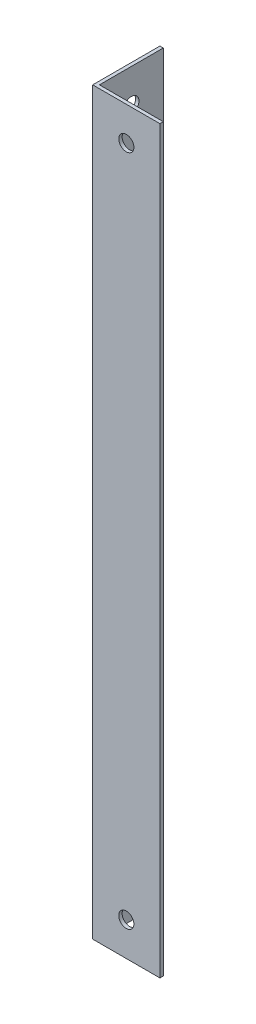
ISO-10303-21;
HEADER;
FILE_DESCRIPTION(('STEP AP214'),'2;1');
FILE_NAME('part.step','',(''),(''),'','','');
FILE_SCHEMA(('AUTOMOTIVE_DESIGN { 1 0 10303 214 1 1 1 1 }'));
ENDSEC;
DATA;
#1=APPLICATION_CONTEXT('core data for automotive mechanical design processes');
#2=APPLICATION_PROTOCOL_DEFINITION('international standard','automotive_design',2000,#1);
#3=PRODUCT_CONTEXT('',#1,'mechanical');
#4=PRODUCT('Part','Part','',(#3));
#5=PRODUCT_RELATED_PRODUCT_CATEGORY('part','',(#4));
#6=PRODUCT_DEFINITION_FORMATION('','',#4);
#7=PRODUCT_DEFINITION_CONTEXT('part definition',#1,'design');
#8=PRODUCT_DEFINITION('design','',#6,#7);
#9=PRODUCT_DEFINITION_SHAPE('','',#8);
#10=(LENGTH_UNIT() NAMED_UNIT(*) SI_UNIT(.MILLI.,.METRE.));
#11=(NAMED_UNIT(*) PLANE_ANGLE_UNIT() SI_UNIT($,.RADIAN.));
#12=(NAMED_UNIT(*) SI_UNIT($,.STERADIAN.) SOLID_ANGLE_UNIT());
#13=UNCERTAINTY_MEASURE_WITH_UNIT(LENGTH_MEASURE(1.E-05),#10,'distance_accuracy_value','');
#14=(GEOMETRIC_REPRESENTATION_CONTEXT(3) GLOBAL_UNCERTAINTY_ASSIGNED_CONTEXT((#13)) GLOBAL_UNIT_ASSIGNED_CONTEXT((#10,
#11,#12)) REPRESENTATION_CONTEXT('',''));
#15=CARTESIAN_POINT('',(0.,0.,0.));
#16=DIRECTION('',(0.,0.,1.));
#17=DIRECTION('',(1.,0.,0.));
#18=AXIS2_PLACEMENT_3D('',#15,#16,#17);
#19=CARTESIAN_POINT('',(20.,220.,0.));
#20=DIRECTION('',(0.,0.,-1.));
#21=DIRECTION('',(-1.,0.,0.));
#22=AXIS2_PLACEMENT_3D('',#19,#20,#21);
#23=PLANE('',#22);
#24=CARTESIAN_POINT('',(10.,210.,0.));
#25=DIRECTION('',(0.,0.,-1.));
#26=DIRECTION('',(-1.,0.,0.));
#27=AXIS2_PLACEMENT_3D('',#24,#25,#26);
#28=CIRCLE('',#27,2.25);
#29=CARTESIAN_POINT('',(7.75,210.,0.));
#30=VERTEX_POINT('',#29);
#31=EDGE_CURVE('E181',#30,#30,#28,.T.);
#32=ORIENTED_EDGE('',*,*,#31,.T.);
#33=EDGE_LOOP('',(#32));
#34=FACE_BOUND('',#33,.T.);
#35=CARTESIAN_POINT('',(10.,10.,0.));
#36=DIRECTION('',(0.,0.,-1.));
#37=DIRECTION('',(-1.,0.,0.));
#38=AXIS2_PLACEMENT_3D('',#35,#36,#37);
#39=CIRCLE('',#38,2.25);
#40=CARTESIAN_POINT('',(7.75,10.,0.));
#41=VERTEX_POINT('',#40);
#42=EDGE_CURVE('E184',#41,#41,#39,.T.);
#43=ORIENTED_EDGE('',*,*,#42,.T.);
#44=EDGE_LOOP('',(#43));
#45=FACE_BOUND('',#44,.T.);
#46=DIRECTION('',(1.,0.,0.));
#47=VECTOR('',#46,1.);
#48=CARTESIAN_POINT('',(20.,0.,0.));
#49=LINE('',#48,#47);
#50=CARTESIAN_POINT('',(0.,0.,0.));
#51=VERTEX_POINT('',#50);
#52=CARTESIAN_POINT('',(20.,0.,0.));
#53=VERTEX_POINT('',#52);
#54=EDGE_CURVE('E135',#51,#53,#49,.T.);
#55=ORIENTED_EDGE('',*,*,#54,.T.);
#56=DIRECTION('',(0.,-1.,0.));
#57=VECTOR('',#56,1.);
#58=CARTESIAN_POINT('',(20.,220.,0.));
#59=LINE('',#58,#57);
#60=CARTESIAN_POINT('',(20.,220.,0.));
#61=VERTEX_POINT('',#60);
#62=EDGE_CURVE('E13',#61,#53,#59,.T.);
#63=ORIENTED_EDGE('',*,*,#62,.F.);
#64=DIRECTION('',(1.,0.,0.));
#65=VECTOR('',#64,1.);
#66=CARTESIAN_POINT('',(20.,220.,0.));
#67=LINE('',#66,#65);
#68=CARTESIAN_POINT('',(0.,220.,0.));
#69=VERTEX_POINT('',#68);
#70=EDGE_CURVE('E146',#69,#61,#67,.T.);
#71=ORIENTED_EDGE('',*,*,#70,.F.);
#72=DIRECTION('',(0.,-1.,0.));
#73=VECTOR('',#72,1.);
#74=CARTESIAN_POINT('',(0.,220.,0.));
#75=LINE('',#74,#73);
#76=EDGE_CURVE('E131',#69,#51,#75,.T.);
#77=ORIENTED_EDGE('',*,*,#76,.T.);
#78=EDGE_LOOP('',(#55,#63,#71,#77));
#79=FACE_BOUND('',#78,.T.);
#80=ADVANCED_FACE('F51',(#34,#45,#79),#23,.F.);
#81=CARTESIAN_POINT('',(20.,220.,-1.));
#82=DIRECTION('',(-1.,0.,0.));
#83=DIRECTION('',(0.,0.,1.));
#84=AXIS2_PLACEMENT_3D('',#81,#82,#83);
#85=PLANE('',#84);
#86=DIRECTION('',(0.,0.,-1.));
#87=VECTOR('',#86,1.);
#88=CARTESIAN_POINT('',(20.,0.,-1.));
#89=LINE('',#88,#87);
#90=CARTESIAN_POINT('',(20.,0.,-1.));
#91=VERTEX_POINT('',#90);
#92=EDGE_CURVE('E138',#53,#91,#89,.T.);
#93=ORIENTED_EDGE('',*,*,#92,.T.);
#94=DIRECTION('',(0.,-1.,0.));
#95=VECTOR('',#94,1.);
#96=CARTESIAN_POINT('',(20.,220.,-1.));
#97=LINE('',#96,#95);
#98=CARTESIAN_POINT('',(20.,220.,-1.));
#99=VERTEX_POINT('',#98);
#100=EDGE_CURVE('E59',#99,#91,#97,.T.);
#101=ORIENTED_EDGE('',*,*,#100,.F.);
#102=DIRECTION('',(0.,0.,-1.));
#103=VECTOR('',#102,1.);
#104=CARTESIAN_POINT('',(20.,220.,-1.));
#105=LINE('',#104,#103);
#106=EDGE_CURVE('E104',#61,#99,#105,.T.);
#107=ORIENTED_EDGE('',*,*,#106,.F.);
#108=ORIENTED_EDGE('',*,*,#62,.T.);
#109=EDGE_LOOP('',(#93,#101,#107,#108));
#110=FACE_BOUND('',#109,.T.);
#111=ADVANCED_FACE('F173',(#110),#85,.F.);
#112=CARTESIAN_POINT('',(0.999999999999997,220.,-1.));
#113=DIRECTION('',(0.,0.,1.));
#114=DIRECTION('',(1.,0.,0.));
#115=AXIS2_PLACEMENT_3D('',#112,#113,#114);
#116=PLANE('',#115);
#117=CARTESIAN_POINT('',(10.,210.,-1.));
#118=DIRECTION('',(0.,0.,-1.));
#119=DIRECTION('',(-1.,0.,0.));
#120=AXIS2_PLACEMENT_3D('',#117,#118,#119);
#121=CIRCLE('',#120,2.25);
#122=CARTESIAN_POINT('',(7.75,210.,-1.));
#123=VERTEX_POINT('',#122);
#124=EDGE_CURVE('E195',#123,#123,#121,.T.);
#125=ORIENTED_EDGE('',*,*,#124,.F.);
#126=EDGE_LOOP('',(#125));
#127=FACE_BOUND('',#126,.T.);
#128=CARTESIAN_POINT('',(10.,10.,-0.999999999999973));
#129=DIRECTION('',(0.,0.,-1.));
#130=DIRECTION('',(-1.,0.,0.));
#131=AXIS2_PLACEMENT_3D('',#128,#129,#130);
#132=CIRCLE('',#131,2.25);
#133=CARTESIAN_POINT('',(7.75,10.,-0.999999999999973));
#134=VERTEX_POINT('',#133);
#135=EDGE_CURVE('E187',#134,#134,#132,.T.);
#136=ORIENTED_EDGE('',*,*,#135,.F.);
#137=EDGE_LOOP('',(#136));
#138=FACE_BOUND('',#137,.T.);
#139=DIRECTION('',(-1.,0.,0.));
#140=VECTOR('',#139,1.);
#141=CARTESIAN_POINT('',(0.999999999999997,0.,-1.));
#142=LINE('',#141,#140);
#143=CARTESIAN_POINT('',(0.999999999999997,0.,-1.));
#144=VERTEX_POINT('',#143);
#145=EDGE_CURVE('E141',#91,#144,#142,.T.);
#146=ORIENTED_EDGE('',*,*,#145,.T.);
#147=DIRECTION('',(0.,-1.,0.));
#148=VECTOR('',#147,1.);
#149=CARTESIAN_POINT('',(0.999999999999997,220.,-1.));
#150=LINE('',#149,#148);
#151=CARTESIAN_POINT('',(0.999999999999997,220.,-1.));
#152=VERTEX_POINT('',#151);
#153=EDGE_CURVE('E126',#152,#144,#150,.T.);
#154=ORIENTED_EDGE('',*,*,#153,.F.);
#155=DIRECTION('',(-1.,0.,0.));
#156=VECTOR('',#155,1.);
#157=CARTESIAN_POINT('',(0.999999999999997,220.,-1.));
#158=LINE('',#157,#156);
#159=EDGE_CURVE('E117',#99,#152,#158,.T.);
#160=ORIENTED_EDGE('',*,*,#159,.F.);
#161=ORIENTED_EDGE('',*,*,#100,.T.);
#162=EDGE_LOOP('',(#146,#154,#160,#161));
#163=FACE_BOUND('',#162,.T.);
#164=ADVANCED_FACE('F152',(#127,#138,#163),#116,.F.);
#165=CARTESIAN_POINT('',(0.999999999999997,220.,-20.));
#166=DIRECTION('',(-1.,0.,0.));
#167=DIRECTION('',(0.,0.,1.));
#168=AXIS2_PLACEMENT_3D('',#165,#166,#167);
#169=PLANE('',#168);
#170=CARTESIAN_POINT('',(0.999999999999997,210.,-10.5000000000001));
#171=DIRECTION('',(1.,0.,0.));
#172=DIRECTION('',(0.,0.,-1.));
#173=AXIS2_PLACEMENT_3D('',#170,#171,#172);
#174=CIRCLE('',#173,2.25);
#175=CARTESIAN_POINT('',(0.999999999999997,210.,-12.7500000000001));
#176=VERTEX_POINT('',#175);
#177=EDGE_CURVE('E186',#176,#176,#174,.T.);
#178=ORIENTED_EDGE('',*,*,#177,.F.);
#179=EDGE_LOOP('',(#178));
#180=FACE_BOUND('',#179,.T.);
#181=CARTESIAN_POINT('',(0.999999999999997,10.,-10.5));
#182=DIRECTION('',(1.,0.,0.));
#183=DIRECTION('',(0.,0.,-1.));
#184=AXIS2_PLACEMENT_3D('',#181,#182,#183);
#185=CIRCLE('',#184,2.25);
#186=CARTESIAN_POINT('',(0.999999999999997,10.,-12.75));
#187=VERTEX_POINT('',#186);
#188=EDGE_CURVE('E198',#187,#187,#185,.T.);
#189=ORIENTED_EDGE('',*,*,#188,.F.);
#190=EDGE_LOOP('',(#189));
#191=FACE_BOUND('',#190,.T.);
#192=CARTESIAN_POINT('',(0.999999999999997,60.,-10.5));
#193=DIRECTION('',(1.,0.,0.));
#194=DIRECTION('',(0.,0.,-1.));
#195=AXIS2_PLACEMENT_3D('',#192,#193,#194);
#196=CIRCLE('',#195,4.25000000000001);
#197=CARTESIAN_POINT('',(0.999999999999997,60.,-14.75));
#198=VERTEX_POINT('',#197);
#199=EDGE_CURVE('E203',#198,#198,#196,.T.);
#200=ORIENTED_EDGE('',*,*,#199,.F.);
#201=EDGE_LOOP('',(#200));
#202=FACE_BOUND('',#201,.T.);
#203=CARTESIAN_POINT('',(0.999999999999997,120.,-10.5));
#204=DIRECTION('',(1.,0.,0.));
#205=DIRECTION('',(0.,0.,-1.));
#206=AXIS2_PLACEMENT_3D('',#203,#204,#205);
#207=CIRCLE('',#206,4.25000000000001);
#208=CARTESIAN_POINT('',(0.999999999999997,120.,-14.75));
#209=VERTEX_POINT('',#208);
#210=EDGE_CURVE('E209',#209,#209,#207,.T.);
#211=ORIENTED_EDGE('',*,*,#210,.F.);
#212=EDGE_LOOP('',(#211));
#213=FACE_BOUND('',#212,.T.);
#214=CARTESIAN_POINT('',(0.999999999999997,180.,-10.5));
#215=DIRECTION('',(1.,0.,0.));
#216=DIRECTION('',(0.,0.,-1.));
#217=AXIS2_PLACEMENT_3D('',#214,#215,#216);
#218=CIRCLE('',#217,4.25000000000001);
#219=CARTESIAN_POINT('',(0.999999999999997,180.,-14.75));
#220=VERTEX_POINT('',#219);
#221=EDGE_CURVE('E215',#220,#220,#218,.T.);
#222=ORIENTED_EDGE('',*,*,#221,.F.);
#223=EDGE_LOOP('',(#222));
#224=FACE_BOUND('',#223,.T.);
#225=DIRECTION('',(0.,0.,-1.));
#226=VECTOR('',#225,1.);
#227=CARTESIAN_POINT('',(0.999999999999997,0.,-20.));
#228=LINE('',#227,#226);
#229=CARTESIAN_POINT('',(0.999999999999997,0.,-20.));
#230=VERTEX_POINT('',#229);
#231=EDGE_CURVE('E125',#144,#230,#228,.T.);
#232=ORIENTED_EDGE('',*,*,#231,.T.);
#233=DIRECTION('',(0.,-1.,0.));
#234=VECTOR('',#233,1.);
#235=CARTESIAN_POINT('',(0.999999999999997,220.,-20.));
#236=LINE('',#235,#234);
#237=CARTESIAN_POINT('',(0.999999999999997,220.,-20.));
#238=VERTEX_POINT('',#237);
#239=EDGE_CURVE('E122',#238,#230,#236,.T.);
#240=ORIENTED_EDGE('',*,*,#239,.F.);
#241=DIRECTION('',(0.,0.,-1.));
#242=VECTOR('',#241,1.);
#243=CARTESIAN_POINT('',(0.999999999999997,220.,-20.));
#244=LINE('',#243,#242);
#245=EDGE_CURVE('E111',#152,#238,#244,.T.);
#246=ORIENTED_EDGE('',*,*,#245,.F.);
#247=ORIENTED_EDGE('',*,*,#153,.T.);
#248=EDGE_LOOP('',(#232,#240,#246,#247));
#249=FACE_BOUND('',#248,.T.);
#250=ADVANCED_FACE('F123',(#180,#191,#202,#213,#224,#249),#169,.F.);
#251=CARTESIAN_POINT('',(0.,220.,-20.));
#252=DIRECTION('',(0.,0.,1.));
#253=DIRECTION('',(1.,0.,0.));
#254=AXIS2_PLACEMENT_3D('',#251,#252,#253);
#255=PLANE('',#254);
#256=DIRECTION('',(-1.,0.,0.));
#257=VECTOR('',#256,1.);
#258=CARTESIAN_POINT('',(0.,0.,-20.));
#259=LINE('',#258,#257);
#260=CARTESIAN_POINT('',(0.,0.,-20.));
#261=VERTEX_POINT('',#260);
#262=EDGE_CURVE('E90',#230,#261,#259,.T.);
#263=ORIENTED_EDGE('',*,*,#262,.T.);
#264=DIRECTION('',(0.,-1.,0.));
#265=VECTOR('',#264,1.);
#266=CARTESIAN_POINT('',(0.,220.,-20.));
#267=LINE('',#266,#265);
#268=CARTESIAN_POINT('',(0.,220.,-20.));
#269=VERTEX_POINT('',#268);
#270=EDGE_CURVE('E127',#269,#261,#267,.T.);
#271=ORIENTED_EDGE('',*,*,#270,.F.);
#272=DIRECTION('',(-1.,0.,0.));
#273=VECTOR('',#272,1.);
#274=CARTESIAN_POINT('',(0.,220.,-20.));
#275=LINE('',#274,#273);
#276=EDGE_CURVE('E115',#238,#269,#275,.T.);
#277=ORIENTED_EDGE('',*,*,#276,.F.);
#278=ORIENTED_EDGE('',*,*,#239,.T.);
#279=EDGE_LOOP('',(#263,#271,#277,#278));
#280=FACE_BOUND('',#279,.T.);
#281=ADVANCED_FACE('F129',(#280),#255,.F.);
#282=CARTESIAN_POINT('',(0.,220.,0.));
#283=DIRECTION('',(1.,0.,0.));
#284=DIRECTION('',(0.,0.,-1.));
#285=AXIS2_PLACEMENT_3D('',#282,#283,#284);
#286=PLANE('',#285);
#287=CARTESIAN_POINT('',(0.,210.,-10.5000000000001));
#288=DIRECTION('',(1.,0.,0.));
#289=DIRECTION('',(0.,0.,-1.));
#290=AXIS2_PLACEMENT_3D('',#287,#288,#289);
#291=CIRCLE('',#290,2.25);
#292=CARTESIAN_POINT('',(0.,210.,-12.7500000000001));
#293=VERTEX_POINT('',#292);
#294=EDGE_CURVE('E190',#293,#293,#291,.T.);
#295=ORIENTED_EDGE('',*,*,#294,.T.);
#296=EDGE_LOOP('',(#295));
#297=FACE_BOUND('',#296,.T.);
#298=CARTESIAN_POINT('',(0.,10.,-10.5));
#299=DIRECTION('',(1.,0.,0.));
#300=DIRECTION('',(0.,0.,-1.));
#301=AXIS2_PLACEMENT_3D('',#298,#299,#300);
#302=CIRCLE('',#301,2.25);
#303=CARTESIAN_POINT('',(0.,10.,-12.75));
#304=VERTEX_POINT('',#303);
#305=EDGE_CURVE('E200',#304,#304,#302,.T.);
#306=ORIENTED_EDGE('',*,*,#305,.T.);
#307=EDGE_LOOP('',(#306));
#308=FACE_BOUND('',#307,.T.);
#309=CARTESIAN_POINT('',(0.,60.,-10.5));
#310=DIRECTION('',(1.,0.,0.));
#311=DIRECTION('',(0.,0.,-1.));
#312=AXIS2_PLACEMENT_3D('',#309,#310,#311);
#313=CIRCLE('',#312,4.25000000000001);
#314=CARTESIAN_POINT('',(0.,60.,-14.75));
#315=VERTEX_POINT('',#314);
#316=EDGE_CURVE('E206',#315,#315,#313,.T.);
#317=ORIENTED_EDGE('',*,*,#316,.T.);
#318=EDGE_LOOP('',(#317));
#319=FACE_BOUND('',#318,.T.);
#320=CARTESIAN_POINT('',(0.,120.,-10.5));
#321=DIRECTION('',(1.,0.,0.));
#322=DIRECTION('',(0.,0.,-1.));
#323=AXIS2_PLACEMENT_3D('',#320,#321,#322);
#324=CIRCLE('',#323,4.25000000000001);
#325=CARTESIAN_POINT('',(0.,120.,-14.75));
#326=VERTEX_POINT('',#325);
#327=EDGE_CURVE('E212',#326,#326,#324,.T.);
#328=ORIENTED_EDGE('',*,*,#327,.T.);
#329=EDGE_LOOP('',(#328));
#330=FACE_BOUND('',#329,.T.);
#331=CARTESIAN_POINT('',(0.,180.,-10.5));
#332=DIRECTION('',(1.,0.,0.));
#333=DIRECTION('',(0.,0.,-1.));
#334=AXIS2_PLACEMENT_3D('',#331,#332,#333);
#335=CIRCLE('',#334,4.25000000000001);
#336=CARTESIAN_POINT('',(0.,180.,-14.75));
#337=VERTEX_POINT('',#336);
#338=EDGE_CURVE('E139',#337,#337,#335,.T.);
#339=ORIENTED_EDGE('',*,*,#338,.T.);
#340=EDGE_LOOP('',(#339));
#341=FACE_BOUND('',#340,.T.);
#342=DIRECTION('',(0.,0.,1.));
#343=VECTOR('',#342,1.);
#344=CARTESIAN_POINT('',(0.,0.,0.));
#345=LINE('',#344,#343);
#346=EDGE_CURVE('E96',#261,#51,#345,.T.);
#347=ORIENTED_EDGE('',*,*,#346,.T.);
#348=ORIENTED_EDGE('',*,*,#76,.F.);
#349=DIRECTION('',(0.,0.,1.));
#350=VECTOR('',#349,1.);
#351=CARTESIAN_POINT('',(0.,220.,0.));
#352=LINE('',#351,#350);
#353=EDGE_CURVE('E67',#269,#69,#352,.T.);
#354=ORIENTED_EDGE('',*,*,#353,.F.);
#355=ORIENTED_EDGE('',*,*,#270,.T.);
#356=EDGE_LOOP('',(#347,#348,#354,#355));
#357=FACE_BOUND('',#356,.T.);
#358=ADVANCED_FACE('F159',(#297,#308,#319,#330,#341,#357),#286,.F.);
#359=CARTESIAN_POINT('',(0.,220.,0.));
#360=DIRECTION('',(0.,-1.,0.));
#361=DIRECTION('',(0.,0.,-1.));
#362=AXIS2_PLACEMENT_3D('',#359,#360,#361);
#363=PLANE('',#362);
#364=ORIENTED_EDGE('',*,*,#70,.T.);
#365=ORIENTED_EDGE('',*,*,#106,.T.);
#366=ORIENTED_EDGE('',*,*,#159,.T.);
#367=ORIENTED_EDGE('',*,*,#245,.T.);
#368=ORIENTED_EDGE('',*,*,#276,.T.);
#369=ORIENTED_EDGE('',*,*,#353,.T.);
#370=EDGE_LOOP('',(#364,#365,#366,#367,#368,#369));
#371=FACE_BOUND('',#370,.T.);
#372=ADVANCED_FACE('F113',(#371),#363,.F.);
#373=CARTESIAN_POINT('',(0.,0.,0.));
#374=DIRECTION('',(0.,-1.,0.));
#375=DIRECTION('',(0.,0.,-1.));
#376=AXIS2_PLACEMENT_3D('',#373,#374,#375);
#377=PLANE('',#376);
#378=ORIENTED_EDGE('',*,*,#54,.F.);
#379=ORIENTED_EDGE('',*,*,#346,.F.);
#380=ORIENTED_EDGE('',*,*,#262,.F.);
#381=ORIENTED_EDGE('',*,*,#231,.F.);
#382=ORIENTED_EDGE('',*,*,#145,.F.);
#383=ORIENTED_EDGE('',*,*,#92,.F.);
#384=EDGE_LOOP('',(#378,#379,#380,#381,#382,#383));
#385=FACE_BOUND('',#384,.T.);
#386=ADVANCED_FACE('F155',(#385),#377,.T.);
#387=CARTESIAN_POINT('',(0.,180.,-10.5));
#388=DIRECTION('',(1.,0.,0.));
#389=DIRECTION('',(0.,0.,-1.));
#390=AXIS2_PLACEMENT_3D('',#387,#388,#389);
#391=CYLINDRICAL_SURFACE('',#390,4.25000000000001);
#392=ORIENTED_EDGE('',*,*,#338,.F.);
#393=EDGE_LOOP('',(#392));
#394=FACE_BOUND('',#393,.T.);
#395=ORIENTED_EDGE('',*,*,#221,.T.);
#396=EDGE_LOOP('',(#395));
#397=FACE_BOUND('',#396,.T.);
#398=ADVANCED_FACE('F225',(#394,#397),#391,.F.);
#399=CARTESIAN_POINT('',(0.,120.,-10.5));
#400=DIRECTION('',(1.,0.,0.));
#401=DIRECTION('',(0.,0.,-1.));
#402=AXIS2_PLACEMENT_3D('',#399,#400,#401);
#403=CYLINDRICAL_SURFACE('',#402,4.25000000000001);
#404=ORIENTED_EDGE('',*,*,#327,.F.);
#405=EDGE_LOOP('',(#404));
#406=FACE_BOUND('',#405,.T.);
#407=ORIENTED_EDGE('',*,*,#210,.T.);
#408=EDGE_LOOP('',(#407));
#409=FACE_BOUND('',#408,.T.);
#410=ADVANCED_FACE('F243',(#406,#409),#403,.F.);
#411=CARTESIAN_POINT('',(0.,60.,-10.5));
#412=DIRECTION('',(1.,0.,0.));
#413=DIRECTION('',(0.,0.,-1.));
#414=AXIS2_PLACEMENT_3D('',#411,#412,#413);
#415=CYLINDRICAL_SURFACE('',#414,4.25000000000001);
#416=ORIENTED_EDGE('',*,*,#316,.F.);
#417=EDGE_LOOP('',(#416));
#418=FACE_BOUND('',#417,.T.);
#419=ORIENTED_EDGE('',*,*,#199,.T.);
#420=EDGE_LOOP('',(#419));
#421=FACE_BOUND('',#420,.T.);
#422=ADVANCED_FACE('F245',(#418,#421),#415,.F.);
#423=CARTESIAN_POINT('',(0.,10.,-10.5));
#424=DIRECTION('',(1.,0.,0.));
#425=DIRECTION('',(0.,0.,-1.));
#426=AXIS2_PLACEMENT_3D('',#423,#424,#425);
#427=CYLINDRICAL_SURFACE('',#426,2.25);
#428=ORIENTED_EDGE('',*,*,#305,.F.);
#429=EDGE_LOOP('',(#428));
#430=FACE_BOUND('',#429,.T.);
#431=ORIENTED_EDGE('',*,*,#188,.T.);
#432=EDGE_LOOP('',(#431));
#433=FACE_BOUND('',#432,.T.);
#434=ADVANCED_FACE('F252',(#430,#433),#427,.F.);
#435=CARTESIAN_POINT('',(0.,210.,-10.5000000000001));
#436=DIRECTION('',(1.,0.,0.));
#437=DIRECTION('',(0.,0.,-1.));
#438=AXIS2_PLACEMENT_3D('',#435,#436,#437);
#439=CYLINDRICAL_SURFACE('',#438,2.25);
#440=ORIENTED_EDGE('',*,*,#294,.F.);
#441=EDGE_LOOP('',(#440));
#442=FACE_BOUND('',#441,.T.);
#443=ORIENTED_EDGE('',*,*,#177,.T.);
#444=EDGE_LOOP('',(#443));
#445=FACE_BOUND('',#444,.T.);
#446=ADVANCED_FACE('F281',(#442,#445),#439,.F.);
#447=CARTESIAN_POINT('',(10.,10.,0.));
#448=DIRECTION('',(0.,0.,-1.));
#449=DIRECTION('',(-1.,0.,0.));
#450=AXIS2_PLACEMENT_3D('',#447,#448,#449);
#451=CYLINDRICAL_SURFACE('',#450,2.25);
#452=ORIENTED_EDGE('',*,*,#42,.F.);
#453=EDGE_LOOP('',(#452));
#454=FACE_BOUND('',#453,.T.);
#455=ORIENTED_EDGE('',*,*,#135,.T.);
#456=EDGE_LOOP('',(#455));
#457=FACE_BOUND('',#456,.T.);
#458=ADVANCED_FACE('F288',(#454,#457),#451,.F.);
#459=CARTESIAN_POINT('',(10.,210.,0.));
#460=DIRECTION('',(0.,0.,-1.));
#461=DIRECTION('',(-1.,0.,0.));
#462=AXIS2_PLACEMENT_3D('',#459,#460,#461);
#463=CYLINDRICAL_SURFACE('',#462,2.25);
#464=ORIENTED_EDGE('',*,*,#31,.F.);
#465=EDGE_LOOP('',(#464));
#466=FACE_BOUND('',#465,.T.);
#467=ORIENTED_EDGE('',*,*,#124,.T.);
#468=EDGE_LOOP('',(#467));
#469=FACE_BOUND('',#468,.T.);
#470=ADVANCED_FACE('F296',(#466,#469),#463,.F.);
#471=CLOSED_SHELL('',(#80,#111,#164,#250,#281,#358,#372,#386,#398,#410,#422,#434,#446,#458,#470));
#472=MANIFOLD_SOLID_BREP('B2',#471);
#473=ADVANCED_BREP_SHAPE_REPRESENTATION('',(#18,#472),#14);
#474=SHAPE_DEFINITION_REPRESENTATION(#9,#473);
ENDSEC;
END-ISO-10303-21;
